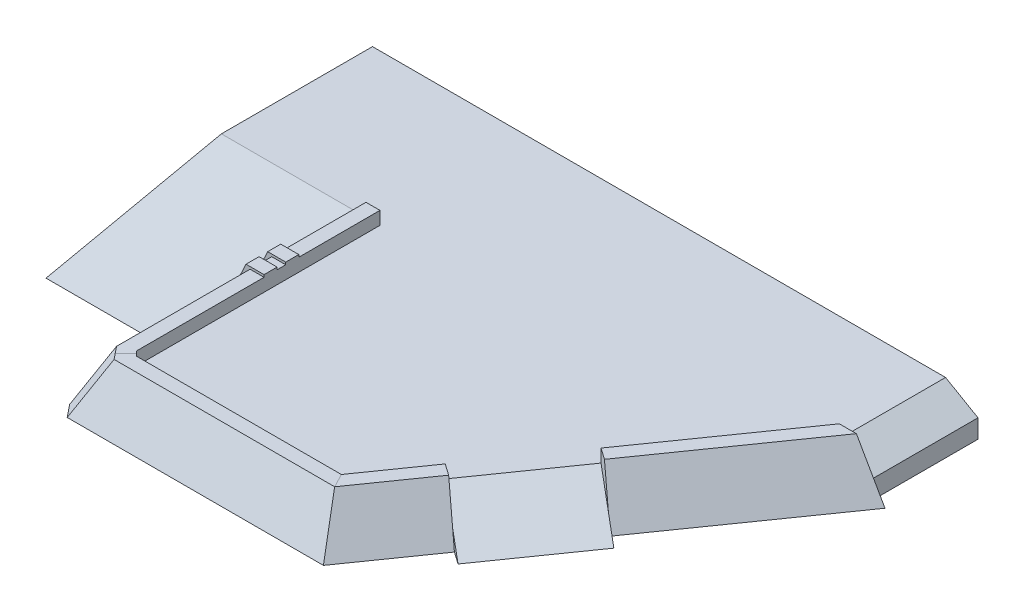
ISO-10303-21;
HEADER;
FILE_DESCRIPTION(('STEP AP214'),'2;1');
FILE_NAME('part.step','',(''),(''),'','','');
FILE_SCHEMA(('AUTOMOTIVE_DESIGN { 1 0 10303 214 1 1 1 1 }'));
ENDSEC;
DATA;
#1=APPLICATION_CONTEXT('core data for automotive mechanical design processes');
#2=APPLICATION_PROTOCOL_DEFINITION('international standard','automotive_design',2000,#1);
#3=PRODUCT_CONTEXT('',#1,'mechanical');
#4=PRODUCT('Part','Part','',(#3));
#5=PRODUCT_RELATED_PRODUCT_CATEGORY('part','',(#4));
#6=PRODUCT_DEFINITION_FORMATION('','',#4);
#7=PRODUCT_DEFINITION_CONTEXT('part definition',#1,'design');
#8=PRODUCT_DEFINITION('design','',#6,#7);
#9=PRODUCT_DEFINITION_SHAPE('','',#8);
#10=(LENGTH_UNIT() NAMED_UNIT(*) SI_UNIT(.MILLI.,.METRE.));
#11=(NAMED_UNIT(*) PLANE_ANGLE_UNIT() SI_UNIT($,.RADIAN.));
#12=(NAMED_UNIT(*) SI_UNIT($,.STERADIAN.) SOLID_ANGLE_UNIT());
#13=UNCERTAINTY_MEASURE_WITH_UNIT(LENGTH_MEASURE(1.E-05),#10,'distance_accuracy_value','');
#14=(GEOMETRIC_REPRESENTATION_CONTEXT(3) GLOBAL_UNCERTAINTY_ASSIGNED_CONTEXT((#13)) GLOBAL_UNIT_ASSIGNED_CONTEXT((#10,
#11,#12)) REPRESENTATION_CONTEXT('',''));
#15=CARTESIAN_POINT('',(0.,0.,0.));
#16=DIRECTION('',(0.,0.,1.));
#17=DIRECTION('',(1.,0.,0.));
#18=AXIS2_PLACEMENT_3D('',#15,#16,#17);
#19=CARTESIAN_POINT('',(6840.82032302756,0.,1140.07438516733));
#20=DIRECTION('',(0.499999999999995,0.866025403784442,0.));
#21=DIRECTION('',(-0.866025403784442,0.499999999999995,0.));
#22=AXIS2_PLACEMENT_3D('',#19,#20,#21);
#23=PLANE('',#22);
#24=DIRECTION('',(-0.866025403784442,0.499999999999995,0.));
#25=VECTOR('',#24,1.);
#26=CARTESIAN_POINT('',(6840.82032302756,0.,1140.07438516733));
#27=LINE('',#26,#25);
#28=CARTESIAN_POINT('',(6495.82032302756,199.185842870418,1140.07438516733));
#29=VERTEX_POINT('',#28);
#30=CARTESIAN_POINT('',(6148.,400.,1140.07438516733));
#31=VERTEX_POINT('',#30);
#32=EDGE_CURVE('E444',#29,#31,#27,.T.);
#33=ORIENTED_EDGE('',*,*,#32,.F.);
#34=DIRECTION('',(0.,0.,-1.));
#35=VECTOR('',#34,1.);
#36=CARTESIAN_POINT('',(6495.82032302756,199.185842870418,1140.07438516733));
#37=LINE('',#36,#35);
#38=CARTESIAN_POINT('',(6495.82032302756,199.185842870418,0.));
#39=VERTEX_POINT('',#38);
#40=EDGE_CURVE('E610',#29,#39,#37,.T.);
#41=ORIENTED_EDGE('',*,*,#40,.T.);
#42=DIRECTION('',(0.866025403784441,-0.499999999999995,0.));
#43=VECTOR('',#42,1.);
#44=CARTESIAN_POINT('',(6840.82032302756,0.,0.));
#45=LINE('',#44,#43);
#46=CARTESIAN_POINT('',(6148.,400.,0.));
#47=VERTEX_POINT('',#46);
#48=EDGE_CURVE('E286',#47,#39,#45,.T.);
#49=ORIENTED_EDGE('',*,*,#48,.F.);
#50=DIRECTION('',(0.,0.,-1.));
#51=VECTOR('',#50,1.);
#52=CARTESIAN_POINT('',(6148.,400.,0.));
#53=LINE('',#52,#51);
#54=EDGE_CURVE('E524',#31,#47,#53,.T.);
#55=ORIENTED_EDGE('',*,*,#54,.F.);
#56=EDGE_LOOP('',(#33,#41,#49,#55));
#57=FACE_BOUND('',#56,.T.);
#58=ADVANCED_FACE('F38',(#57),#23,.T.);
#59=CARTESIAN_POINT('',(0.,400.,0.));
#60=DIRECTION('',(0.,0.,1.));
#61=DIRECTION('',(1.,0.,0.));
#62=AXIS2_PLACEMENT_3D('',#59,#60,#61);
#63=PLANE('',#62);
#64=DIRECTION('',(0.,1.,0.));
#65=VECTOR('',#64,1.);
#66=CARTESIAN_POINT('',(6495.82032302756,400.,0.));
#67=LINE('',#66,#65);
#68=CARTESIAN_POINT('',(6495.82032302756,0.,0.));
#69=VERTEX_POINT('',#68);
#70=EDGE_CURVE('E272',#69,#39,#67,.T.);
#71=ORIENTED_EDGE('',*,*,#70,.F.);
#72=DIRECTION('',(-1.,0.,0.));
#73=VECTOR('',#72,1.);
#74=CARTESIAN_POINT('',(0.,0.,0.));
#75=LINE('',#74,#73);
#76=CARTESIAN_POINT('',(0.,0.,0.));
#77=VERTEX_POINT('',#76);
#78=EDGE_CURVE('E282',#69,#77,#75,.T.);
#79=ORIENTED_EDGE('',*,*,#78,.T.);
#80=DIRECTION('',(0.,-1.,0.));
#81=VECTOR('',#80,1.);
#82=CARTESIAN_POINT('',(0.,400.,0.));
#83=LINE('',#82,#81);
#84=CARTESIAN_POINT('',(0.,400.,0.));
#85=VERTEX_POINT('',#84);
#86=EDGE_CURVE('E300',#85,#77,#83,.T.);
#87=ORIENTED_EDGE('',*,*,#86,.F.);
#88=DIRECTION('',(-1.,0.,0.));
#89=VECTOR('',#88,1.);
#90=CARTESIAN_POINT('',(0.,400.,0.));
#91=LINE('',#90,#89);
#92=EDGE_CURVE('E303',#47,#85,#91,.T.);
#93=ORIENTED_EDGE('',*,*,#92,.F.);
#94=ORIENTED_EDGE('',*,*,#48,.T.);
#95=EDGE_LOOP('',(#71,#79,#87,#93,#94));
#96=FACE_BOUND('',#95,.T.);
#97=ADVANCED_FACE('F280',(#96),#63,.F.);
#98=CARTESIAN_POINT('',(6557.66102481887,539.392949833121,816.534828475489));
#99=DIRECTION('',(-0.742403876506104,-0.422618261740704,-0.519836790725681));
#100=DIRECTION('',(-0.573576436351044,0.,0.819152044288994));
#101=AXIS2_PLACEMENT_3D('',#98,#99,#100);
#102=PLANE('',#101);
#103=DIRECTION('',(-0.346188613058758,0.906307787036648,-0.242403876506106));
#104=VECTOR('',#103,1.);
#105=CARTESIAN_POINT('',(5218.02567934543,539.392949833122,2729.73237687467));
#106=LINE('',#105,#104);
#107=CARTESIAN_POINT('',(5359.04467567405,170.210921101807,2828.47494113473));
#108=VERTEX_POINT('',#107);
#109=CARTESIAN_POINT('',(5218.02567934544,539.392949833121,2729.73237687467));
#110=VERTEX_POINT('',#109);
#111=EDGE_CURVE('E365',#108,#110,#106,.T.);
#112=ORIENTED_EDGE('',*,*,#111,.F.);
#113=DIRECTION('',(-0.346188613058758,0.906307787036648,-0.242403876506106));
#114=VECTOR('',#113,1.);
#115=CARTESIAN_POINT('',(5218.02567934543,539.392949833122,2729.73237687467));
#116=LINE('',#115,#114);
#117=CARTESIAN_POINT('',(5424.06131080233,1.87072206076798E-12,2874.00007916059));
#118=VERTEX_POINT('',#117);
#119=EDGE_CURVE('E11',#118,#108,#116,.T.);
#120=ORIENTED_EDGE('',*,*,#119,.F.);
#121=DIRECTION('',(-0.573576436351044,0.,0.819152044288994));
#122=VECTOR('',#121,1.);
#123=CARTESIAN_POINT('',(6763.69665627577,0.,960.802530761407));
#124=LINE('',#123,#122);
#125=CARTESIAN_POINT('',(6638.16915243191,0.,1140.07438516733));
#126=VERTEX_POINT('',#125);
#127=EDGE_CURVE('E462',#126,#118,#124,.T.);
#128=ORIENTED_EDGE('',*,*,#127,.F.);
#129=DIRECTION('',(0.49471530048269,-0.869055102665142,0.));
#130=VECTOR('',#129,1.);
#131=CARTESIAN_POINT('',(5013.52220252633,2853.98030032064,1140.07438516733));
#132=LINE('',#131,#130);
#133=CARTESIAN_POINT('',(6331.11618831422,539.392949833121,1140.07438516733));
#134=VERTEX_POINT('',#133);
#135=EDGE_CURVE('E302',#134,#126,#132,.T.);
#136=ORIENTED_EDGE('',*,*,#135,.F.);
#137=DIRECTION('',(-0.573576436351044,0.,0.819152044288994));
#138=VECTOR('',#137,1.);
#139=CARTESIAN_POINT('',(6557.66102481887,539.392949833121,816.534828475489));
#140=LINE('',#139,#138);
#141=EDGE_CURVE('E468',#134,#110,#140,.T.);
#142=ORIENTED_EDGE('',*,*,#141,.T.);
#143=EDGE_LOOP('',(#112,#120,#128,#136,#142));
#144=FACE_BOUND('',#143,.T.);
#145=ADVANCED_FACE('F596',(#144),#102,.F.);
#146=CARTESIAN_POINT('',(6434.78821817552,539.392949833121,730.498363022833));
#147=DIRECTION('',(0.,-1.,0.));
#148=DIRECTION('',(1.,0.,0.));
#149=AXIS2_PLACEMENT_3D('',#146,#147,#148);
#150=PLANE('',#149);
#151=DIRECTION('',(-0.819152044288994,0.,-0.573576436351044));
#152=VECTOR('',#151,1.);
#153=CARTESIAN_POINT('',(5095.15287270209,539.392949833121,2643.69591142202));
#154=LINE('',#153,#152);
#155=CARTESIAN_POINT('',(5095.15287270209,539.392949833121,2643.69591142202));
#156=VERTEX_POINT('',#155);
#157=EDGE_CURVE('E369',#110,#156,#154,.T.);
#158=ORIENTED_EDGE('',*,*,#157,.F.);
#159=ORIENTED_EDGE('',*,*,#141,.F.);
#160=DIRECTION('',(-1.,0.,0.));
#161=VECTOR('',#160,1.);
#162=CARTESIAN_POINT('',(6434.78821817552,539.392949833121,1140.07438516733));
#163=LINE('',#162,#161);
#164=CARTESIAN_POINT('',(6148.,539.392949833121,1140.07438516733));
#165=VERTEX_POINT('',#164);
#166=EDGE_CURVE('E446',#134,#165,#163,.T.);
#167=ORIENTED_EDGE('',*,*,#166,.T.);
#168=DIRECTION('',(-0.573576436351044,0.,0.819152044288994));
#169=VECTOR('',#168,1.);
#170=CARTESIAN_POINT('',(6434.78821817552,539.392949833121,730.498363022833));
#171=LINE('',#170,#169);
#172=EDGE_CURVE('E463',#165,#156,#171,.T.);
#173=ORIENTED_EDGE('',*,*,#172,.T.);
#174=EDGE_LOOP('',(#158,#159,#167,#173));
#175=FACE_BOUND('',#174,.T.);
#176=ADVANCED_FACE('F604',(#175),#150,.F.);
#177=CARTESIAN_POINT('',(6434.78821817552,400.,730.498363022832));
#178=DIRECTION('',(0.819152044288994,0.,0.573576436351044));
#179=DIRECTION('',(0.573576436351044,0.,-0.819152044288994));
#180=AXIS2_PLACEMENT_3D('',#177,#178,#179);
#181=PLANE('',#180);
#182=DIRECTION('',(0.,1.,0.));
#183=VECTOR('',#182,1.);
#184=CARTESIAN_POINT('',(5095.15287270209,7.59082913873004E-13,2643.69591142202));
#185=LINE('',#184,#183);
#186=CARTESIAN_POINT('',(5095.15287270209,400.,2643.69591142202));
#187=VERTEX_POINT('',#186);
#188=EDGE_CURVE('E582',#187,#156,#185,.T.);
#189=ORIENTED_EDGE('',*,*,#188,.T.);
#190=ORIENTED_EDGE('',*,*,#172,.F.);
#191=DIRECTION('',(0.,1.,0.));
#192=VECTOR('',#191,1.);
#193=CARTESIAN_POINT('',(6148.,400.,1140.07438516733));
#194=LINE('',#193,#192);
#195=EDGE_CURVE('E442',#31,#165,#194,.T.);
#196=ORIENTED_EDGE('',*,*,#195,.F.);
#197=DIRECTION('',(0.573576436351044,0.,-0.819152044288994));
#198=VECTOR('',#197,1.);
#199=CARTESIAN_POINT('',(6148.,400.,1140.07438516733));
#200=LINE('',#199,#198);
#201=EDGE_CURVE('E520',#187,#31,#200,.T.);
#202=ORIENTED_EDGE('',*,*,#201,.F.);
#203=EDGE_LOOP('',(#189,#190,#196,#202));
#204=FACE_BOUND('',#203,.T.);
#205=ADVANCED_FACE('F607',(#204),#181,.F.);
#206=DIRECTION('',(-0.346188613058758,0.906307787036648,-0.242403876506106));
#207=VECTOR('',#206,1.);
#208=CARTESIAN_POINT('',(4529.73395572418,539.392949833123,3712.71483002146));
#209=LINE('',#208,#207);
#210=CARTESIAN_POINT('',(4735.76958718108,1.92623321199924E-12,3856.98253230738));
#211=VERTEX_POINT('',#210);
#212=CARTESIAN_POINT('',(4670.7529520528,170.210921101807,3811.45739428153));
#213=VERTEX_POINT('',#212);
#214=EDGE_CURVE('E47',#211,#213,#209,.T.);
#215=ORIENTED_EDGE('',*,*,#214,.T.);
#216=DIRECTION('',(-0.346188613058758,0.906307787036648,-0.242403876506106));
#217=VECTOR('',#216,1.);
#218=CARTESIAN_POINT('',(4529.73395572418,539.392949833123,3712.71483002146));
#219=LINE('',#218,#217);
#220=CARTESIAN_POINT('',(4529.73395572418,539.392949833121,3712.71483002146));
#221=VERTEX_POINT('',#220);
#222=EDGE_CURVE('E350',#213,#221,#219,.T.);
#223=ORIENTED_EDGE('',*,*,#222,.T.);
#224=CARTESIAN_POINT('',(4026.08505758276,539.392949833121,4432.));
#225=VERTEX_POINT('',#224);
#226=EDGE_CURVE('E466',#221,#225,#140,.T.);
#227=ORIENTED_EDGE('',*,*,#226,.T.);
#228=DIRECTION('',(-0.214862846534994,0.885140273219939,-0.412747687943871));
#229=VECTOR('',#228,1.);
#230=CARTESIAN_POINT('',(3822.32347132957,1378.80092118057,4040.57763464433));
#231=LINE('',#230,#229);
#232=CARTESIAN_POINT('',(4157.0196767708,0.,4683.523063262));
#233=VERTEX_POINT('',#232);
#234=EDGE_CURVE('E456',#233,#225,#231,.T.);
#235=ORIENTED_EDGE('',*,*,#234,.F.);
#236=EDGE_CURVE('E353',#211,#233,#124,.T.);
#237=ORIENTED_EDGE('',*,*,#236,.F.);
#238=EDGE_LOOP('',(#215,#223,#227,#235,#237));
#239=FACE_BOUND('',#238,.T.);
#240=ADVANCED_FACE('F349',(#239),#102,.F.);
#241=CARTESIAN_POINT('',(1551.,539.392949833121,4723.7753695882));
#242=DIRECTION('',(0.906307787036648,-0.422618261740704,0.));
#243=DIRECTION('',(0.422618261740704,0.906307787036648,0.));
#244=AXIS2_PLACEMENT_3D('',#241,#242,#243);
#245=PLANE('',#244);
#246=DIRECTION('',(-0.422618261740704,-0.906307787036648,0.));
#247=VECTOR('',#246,1.);
#248=CARTESIAN_POINT('',(1551.,539.392949833121,2724.6));
#249=LINE('',#248,#247);
#250=CARTESIAN_POINT('',(1551.,539.392949833121,2724.6));
#251=VERTEX_POINT('',#250);
#252=CARTESIAN_POINT('',(1376.6147519434,165.422578540972,2724.6));
#253=VERTEX_POINT('',#252);
#254=EDGE_CURVE('E395',#251,#253,#249,.T.);
#255=ORIENTED_EDGE('',*,*,#254,.F.);
#256=DIRECTION('',(0.,0.,-1.));
#257=VECTOR('',#256,1.);
#258=CARTESIAN_POINT('',(1551.,539.392949833121,4723.7753695882));
#259=LINE('',#258,#257);
#260=CARTESIAN_POINT('',(1551.,539.392949833121,2631.9));
#261=VERTEX_POINT('',#260);
#262=EDGE_CURVE('E504',#251,#261,#259,.T.);
#263=ORIENTED_EDGE('',*,*,#262,.T.);
#264=DIRECTION('',(-0.422618261740704,-0.906307787036648,0.));
#265=VECTOR('',#264,1.);
#266=CARTESIAN_POINT('',(1551.,539.392949833121,2631.9));
#267=LINE('',#266,#265);
#268=CARTESIAN_POINT('',(1385.80287489995,185.126571807782,2631.9));
#269=VERTEX_POINT('',#268);
#270=EDGE_CURVE('E436',#261,#269,#267,.T.);
#271=ORIENTED_EDGE('',*,*,#270,.T.);
#272=DIRECTION('',(-0.0964983581294288,-0.206941396826368,0.973582726406892));
#273=VECTOR('',#272,1.);
#274=CARTESIAN_POINT('',(1454.24729756067,331.906109873991,1941.35656575835));
#275=LINE('',#274,#273);
#276=EDGE_CURVE('E310',#269,#253,#275,.T.);
#277=ORIENTED_EDGE('',*,*,#276,.T.);
#278=EDGE_LOOP('',(#255,#263,#271,#277));
#279=FACE_BOUND('',#278,.T.);
#280=ADVANCED_FACE('F680',(#279),#245,.F.);
#281=CARTESIAN_POINT('',(1701.,539.392949833121,4723.7753695882));
#282=DIRECTION('',(0.,-1.,0.));
#283=DIRECTION('',(1.,0.,0.));
#284=AXIS2_PLACEMENT_3D('',#281,#282,#283);
#285=PLANE('',#284);
#286=DIRECTION('',(-1.,0.,0.));
#287=VECTOR('',#286,1.);
#288=CARTESIAN_POINT('',(1701.,539.392949833121,2724.6));
#289=LINE('',#288,#287);
#290=CARTESIAN_POINT('',(1701.,539.392949833121,2724.6));
#291=VERTEX_POINT('',#290);
#292=EDGE_CURVE('E341',#291,#251,#289,.T.);
#293=ORIENTED_EDGE('',*,*,#292,.F.);
#294=DIRECTION('',(0.,0.,-1.));
#295=VECTOR('',#294,1.);
#296=CARTESIAN_POINT('',(1701.,539.392949833121,4723.7753695882));
#297=LINE('',#296,#295);
#298=CARTESIAN_POINT('',(1701.,539.392949833121,2631.9));
#299=VERTEX_POINT('',#298);
#300=EDGE_CURVE('E506',#291,#299,#297,.T.);
#301=ORIENTED_EDGE('',*,*,#300,.T.);
#302=DIRECTION('',(-1.,0.,0.));
#303=VECTOR('',#302,1.);
#304=CARTESIAN_POINT('',(1701.,539.392949833121,2631.9));
#305=LINE('',#304,#303);
#306=EDGE_CURVE('E338',#299,#261,#305,.T.);
#307=ORIENTED_EDGE('',*,*,#306,.T.);
#308=ORIENTED_EDGE('',*,*,#262,.F.);
#309=EDGE_LOOP('',(#293,#301,#307,#308));
#310=FACE_BOUND('',#309,.T.);
#311=ADVANCED_FACE('F694',(#310),#285,.F.);
#312=DIRECTION('',(-0.422618261740704,-0.906307787036648,0.));
#313=VECTOR('',#312,1.);
#314=CARTESIAN_POINT('',(1551.,539.392949833121,2491.9));
#315=LINE('',#314,#313);
#316=CARTESIAN_POINT('',(1551.,539.392949833121,2491.9));
#317=VERTEX_POINT('',#316);
#318=CARTESIAN_POINT('',(1399.67922024964,214.884490441584,2491.9));
#319=VERTEX_POINT('',#318);
#320=EDGE_CURVE('E428',#317,#319,#315,.T.);
#321=ORIENTED_EDGE('',*,*,#320,.F.);
#322=CARTESIAN_POINT('',(1551.,539.392949833121,1621.));
#323=VERTEX_POINT('',#322);
#324=EDGE_CURVE('E499',#317,#323,#259,.T.);
#325=ORIENTED_EDGE('',*,*,#324,.T.);
#326=DIRECTION('',(-0.422618261740704,-0.906307787036648,0.));
#327=VECTOR('',#326,1.);
#328=CARTESIAN_POINT('',(1551.,539.392949833121,1621.));
#329=LINE('',#328,#327);
#330=CARTESIAN_POINT('',(1486.,400.,1621.));
#331=VERTEX_POINT('',#330);
#332=EDGE_CURVE('E449',#323,#331,#329,.T.);
#333=ORIENTED_EDGE('',*,*,#332,.T.);
#334=EDGE_CURVE('E306',#331,#319,#275,.T.);
#335=ORIENTED_EDGE('',*,*,#334,.T.);
#336=EDGE_LOOP('',(#321,#325,#333,#335));
#337=FACE_BOUND('',#336,.T.);
#338=ADVANCED_FACE('F547',(#337),#245,.F.);
#339=DIRECTION('',(-1.,0.,0.));
#340=VECTOR('',#339,1.);
#341=CARTESIAN_POINT('',(1701.,539.392949833121,2491.9));
#342=LINE('',#341,#340);
#343=CARTESIAN_POINT('',(1701.,539.392949833121,2491.9));
#344=VERTEX_POINT('',#343);
#345=EDGE_CURVE('E335',#344,#317,#342,.T.);
#346=ORIENTED_EDGE('',*,*,#345,.F.);
#347=CARTESIAN_POINT('',(1701.,539.392949833121,1621.));
#348=VERTEX_POINT('',#347);
#349=EDGE_CURVE('E503',#344,#348,#297,.T.);
#350=ORIENTED_EDGE('',*,*,#349,.T.);
#351=DIRECTION('',(-1.,0.,0.));
#352=VECTOR('',#351,1.);
#353=CARTESIAN_POINT('',(1701.,539.392949833121,1621.));
#354=LINE('',#353,#352);
#355=EDGE_CURVE('E490',#348,#323,#354,.T.);
#356=ORIENTED_EDGE('',*,*,#355,.T.);
#357=ORIENTED_EDGE('',*,*,#324,.F.);
#358=EDGE_LOOP('',(#346,#350,#356,#357));
#359=FACE_BOUND('',#358,.T.);
#360=ADVANCED_FACE('F549',(#359),#285,.F.);
#361=CARTESIAN_POINT('',(-1923.89373789772,400.,1621.));
#362=DIRECTION('',(0.,-0.978147600733807,-0.207911690817752));
#363=DIRECTION('',(0.,0.207911690817752,-0.978147600733807));
#364=AXIS2_PLACEMENT_3D('',#361,#362,#363);
#365=PLANE('',#364);
#366=CARTESIAN_POINT('',(1362.7384065937,135.66465990717,2864.6));
#367=VERTEX_POINT('',#366);
#368=CARTESIAN_POINT('',(1299.476936738,0.,3502.85204379145));
#369=VERTEX_POINT('',#368);
#370=EDGE_CURVE('E305',#367,#369,#275,.T.);
#371=ORIENTED_EDGE('',*,*,#370,.F.);
#372=DIRECTION('',(-1.,0.,0.));
#373=VECTOR('',#372,1.);
#374=CARTESIAN_POINT('',(-1923.89373789772,135.66465990717,2864.6));
#375=LINE('',#374,#373);
#376=CARTESIAN_POINT('',(1307.56951064558,135.66465990717,2864.6));
#377=VERTEX_POINT('',#376);
#378=EDGE_CURVE('E405',#367,#377,#375,.T.);
#379=ORIENTED_EDGE('',*,*,#378,.T.);
#380=DIRECTION('',(0.0964983581294297,0.206941396826367,-0.973582726406892));
#381=VECTOR('',#380,1.);
#382=CARTESIAN_POINT('',(1399.59213068201,333.007805418726,1936.17349572711));
#383=LINE('',#382,#381);
#384=CARTESIAN_POINT('',(1321.44585599527,165.422578540972,2724.6));
#385=VERTEX_POINT('',#384);
#386=EDGE_CURVE('E407',#377,#385,#383,.T.);
#387=ORIENTED_EDGE('',*,*,#386,.T.);
#388=DIRECTION('',(-1.,0.,0.));
#389=VECTOR('',#388,1.);
#390=CARTESIAN_POINT('',(-1923.89373789772,165.422578540972,2724.6));
#391=LINE('',#390,#389);
#392=EDGE_CURVE('E400',#253,#385,#391,.T.);
#393=ORIENTED_EDGE('',*,*,#392,.F.);
#394=ORIENTED_EDGE('',*,*,#276,.F.);
#395=DIRECTION('',(-1.,0.,0.));
#396=VECTOR('',#395,1.);
#397=CARTESIAN_POINT('',(-1923.89373789772,185.126571807782,2631.9));
#398=LINE('',#397,#396);
#399=CARTESIAN_POINT('',(1330.63397895182,185.126571807782,2631.9));
#400=VERTEX_POINT('',#399);
#401=EDGE_CURVE('E438',#269,#400,#398,.T.);
#402=ORIENTED_EDGE('',*,*,#401,.T.);
#403=DIRECTION('',(0.0964983581294297,0.206941396826367,-0.973582726406892));
#404=VECTOR('',#403,1.);
#405=CARTESIAN_POINT('',(1399.59213068201,333.007805418726,1936.17349572711));
#406=LINE('',#405,#404);
#407=CARTESIAN_POINT('',(1344.51032430152,214.884490441584,2491.9));
#408=VERTEX_POINT('',#407);
#409=EDGE_CURVE('E440',#400,#408,#406,.T.);
#410=ORIENTED_EDGE('',*,*,#409,.T.);
#411=DIRECTION('',(-1.,0.,0.));
#412=VECTOR('',#411,1.);
#413=CARTESIAN_POINT('',(-1923.89373789772,214.884490441584,2491.9));
#414=LINE('',#413,#412);
#415=EDGE_CURVE('E433',#319,#408,#414,.T.);
#416=ORIENTED_EDGE('',*,*,#415,.F.);
#417=ORIENTED_EDGE('',*,*,#334,.F.);
#418=DIRECTION('',(1.,0.,0.));
#419=VECTOR('',#418,1.);
#420=CARTESIAN_POINT('',(1701.,400.,1621.));
#421=LINE('',#420,#419);
#422=CARTESIAN_POINT('',(0.,400.,1621.));
#423=VERTEX_POINT('',#422);
#424=EDGE_CURVE('E513',#423,#331,#421,.T.);
#425=ORIENTED_EDGE('',*,*,#424,.F.);
#426=DIRECTION('',(0.,-0.207911690817752,0.978147600733807));
#427=VECTOR('',#426,1.);
#428=CARTESIAN_POINT('',(0.,400.,1621.));
#429=LINE('',#428,#427);
#430=CARTESIAN_POINT('',(0.,0.,3502.85204379145));
#431=VERTEX_POINT('',#430);
#432=EDGE_CURVE('E296',#423,#431,#429,.T.);
#433=ORIENTED_EDGE('',*,*,#432,.T.);
#434=DIRECTION('',(1.,0.,0.));
#435=VECTOR('',#434,1.);
#436=CARTESIAN_POINT('',(-1923.89373789772,0.,3502.85204379145));
#437=LINE('',#436,#435);
#438=EDGE_CURVE('E508',#431,#369,#437,.T.);
#439=ORIENTED_EDGE('',*,*,#438,.T.);
#440=EDGE_LOOP('',(#371,#379,#387,#393,#394,#402,#410,#416,#417,#425,#433,#439));
#441=FACE_BOUND('',#440,.T.);
#442=ADVANCED_FACE('F537',(#441),#365,.F.);
#443=CARTESIAN_POINT('',(0.,400.,1621.));
#444=DIRECTION('',(1.,0.,0.));
#445=DIRECTION('',(0.,0.,-1.));
#446=AXIS2_PLACEMENT_3D('',#443,#444,#445);
#447=PLANE('',#446);
#448=DIRECTION('',(0.,0.,1.));
#449=VECTOR('',#448,1.);
#450=CARTESIAN_POINT('',(0.,0.,1621.));
#451=LINE('',#450,#449);
#452=EDGE_CURVE('E291',#77,#431,#451,.T.);
#453=ORIENTED_EDGE('',*,*,#452,.T.);
#454=ORIENTED_EDGE('',*,*,#432,.F.);
#455=DIRECTION('',(0.,0.,1.));
#456=VECTOR('',#455,1.);
#457=CARTESIAN_POINT('',(0.,400.,1621.));
#458=LINE('',#457,#456);
#459=EDGE_CURVE('E292',#85,#423,#458,.T.);
#460=ORIENTED_EDGE('',*,*,#459,.F.);
#461=ORIENTED_EDGE('',*,*,#86,.T.);
#462=EDGE_LOOP('',(#453,#454,#460,#461));
#463=FACE_BOUND('',#462,.T.);
#464=ADVANCED_FACE('F532',(#463),#447,.F.);
#465=CARTESIAN_POINT('',(0.,400.,0.));
#466=DIRECTION('',(0.,-1.,0.));
#467=DIRECTION('',(0.,0.,-1.));
#468=AXIS2_PLACEMENT_3D('',#465,#466,#467);
#469=PLANE('',#468);
#470=DIRECTION('',(0.,0.,1.));
#471=VECTOR('',#470,1.);
#472=CARTESIAN_POINT('',(1701.,400.,4282.));
#473=LINE('',#472,#471);
#474=CARTESIAN_POINT('',(1701.,400.,1621.));
#475=VERTEX_POINT('',#474);
#476=CARTESIAN_POINT('',(1701.,400.,4232.));
#477=VERTEX_POINT('',#476);
#478=EDGE_CURVE('E516',#475,#477,#473,.T.);
#479=ORIENTED_EDGE('',*,*,#478,.T.);
#480=DIRECTION('',(-0.707106781186549,0.,-0.707106781186546));
#481=VECTOR('',#480,1.);
#482=CARTESIAN_POINT('',(1701.,400.000000000002,4232.));
#483=LINE('',#482,#481);
#484=CARTESIAN_POINT('',(1751.,400.,4282.));
#485=VERTEX_POINT('',#484);
#486=EDGE_CURVE('E326',#477,#485,#483,.F.);
#487=ORIENTED_EDGE('',*,*,#486,.T.);
#488=DIRECTION('',(1.,0.,0.));
#489=VECTOR('',#488,1.);
#490=CARTESIAN_POINT('',(3948.,400.,4282.));
#491=LINE('',#490,#489);
#492=CARTESIAN_POINT('',(3948.,400.,4282.));
#493=VERTEX_POINT('',#492);
#494=EDGE_CURVE('E518',#485,#493,#491,.T.);
#495=ORIENTED_EDGE('',*,*,#494,.T.);
#496=CARTESIAN_POINT('',(4406.86114908083,400.,3626.67836456881));
#497=VERTEX_POINT('',#496);
#498=EDGE_CURVE('E521',#493,#497,#200,.T.);
#499=ORIENTED_EDGE('',*,*,#498,.T.);
#500=DIRECTION('',(-0.573576436351044,0.,0.819152044288993));
#501=VECTOR('',#500,1.);
#502=CARTESIAN_POINT('',(5095.15287270209,400.,2643.69591142202));
#503=LINE('',#502,#501);
#504=EDGE_CURVE('E572',#187,#497,#503,.T.);
#505=ORIENTED_EDGE('',*,*,#504,.F.);
#506=ORIENTED_EDGE('',*,*,#201,.T.);
#507=ORIENTED_EDGE('',*,*,#54,.T.);
#508=ORIENTED_EDGE('',*,*,#92,.T.);
#509=ORIENTED_EDGE('',*,*,#459,.T.);
#510=ORIENTED_EDGE('',*,*,#424,.T.);
#511=EDGE_CURVE('E294',#331,#475,#421,.T.);
#512=ORIENTED_EDGE('',*,*,#511,.T.);
#513=EDGE_LOOP('',(#479,#487,#495,#499,#505,#506,#507,#508,#509,#510,#512));
#514=FACE_BOUND('',#513,.T.);
#515=ADVANCED_FACE('F526',(#514),#469,.F.);
#516=CARTESIAN_POINT('',(0.,0.,0.));
#517=DIRECTION('',(0.,-1.,0.));
#518=DIRECTION('',(0.,0.,-1.));
#519=AXIS2_PLACEMENT_3D('',#516,#517,#518);
#520=PLANE('',#519);
#521=DIRECTION('',(0.627215645974674,0.,0.778845641603375));
#522=VECTOR('',#521,1.);
#523=CARTESIAN_POINT('',(-1433.80239762498,0.,1154.66178275715));
#524=LINE('',#523,#522);
#525=CARTESIAN_POINT('',(1359.61251653149,0.,4623.38748346851));
#526=VERTEX_POINT('',#525);
#527=CARTESIAN_POINT('',(1299.476936738,0.,4548.71406846676));
#528=VERTEX_POINT('',#527);
#529=EDGE_CURVE('E319',#526,#528,#524,.F.);
#530=ORIENTED_EDGE('',*,*,#529,.T.);
#531=DIRECTION('',(0.,0.,-1.));
#532=VECTOR('',#531,1.);
#533=CARTESIAN_POINT('',(1299.476936738,0.,4723.7753695882));
#534=LINE('',#533,#532);
#535=EDGE_CURVE('E496',#528,#369,#534,.T.);
#536=ORIENTED_EDGE('',*,*,#535,.T.);
#537=ORIENTED_EDGE('',*,*,#438,.F.);
#538=ORIENTED_EDGE('',*,*,#452,.F.);
#539=ORIENTED_EDGE('',*,*,#78,.F.);
#540=DIRECTION('',(0.,0.,-1.));
#541=VECTOR('',#540,1.);
#542=CARTESIAN_POINT('',(6495.82032302756,0.,1140.07438516733));
#543=LINE('',#542,#541);
#544=CARTESIAN_POINT('',(6495.82032302756,0.,1140.07438516733));
#545=VERTEX_POINT('',#544);
#546=EDGE_CURVE('E269',#545,#69,#543,.T.);
#547=ORIENTED_EDGE('',*,*,#546,.F.);
#548=DIRECTION('',(1.,0.,0.));
#549=VECTOR('',#548,1.);
#550=CARTESIAN_POINT('',(6495.82032302756,0.,1140.07438516733));
#551=LINE('',#550,#549);
#552=EDGE_CURVE('E54',#545,#126,#551,.T.);
#553=ORIENTED_EDGE('',*,*,#552,.T.);
#554=ORIENTED_EDGE('',*,*,#127,.T.);
#555=DIRECTION('',(-0.819152044288994,0.,-0.573576436351044));
#556=VECTOR('',#555,1.);
#557=CARTESIAN_POINT('',(434.123208674579,7.59082913873004E-13,-619.992195149094));
#558=LINE('',#557,#556);
#559=CARTESIAN_POINT('',(5554.51639726519,8.88178419700125E-13,2965.34571409968));
#560=VERTEX_POINT('',#559);
#561=EDGE_CURVE('E367',#560,#118,#558,.T.);
#562=ORIENTED_EDGE('',*,*,#561,.F.);
#563=DIRECTION('',(-0.573576436351044,0.,0.819152044288994));
#564=VECTOR('',#563,1.);
#565=CARTESIAN_POINT('',(5554.51639726519,8.88178419700125E-13,2965.34571409968));
#566=LINE('',#565,#564);
#567=CARTESIAN_POINT('',(4866.22467364394,8.88178419700125E-13,3948.32816724648));
#568=VERTEX_POINT('',#567);
#569=EDGE_CURVE('E364',#560,#568,#566,.T.);
#570=ORIENTED_EDGE('',*,*,#569,.T.);
#571=DIRECTION('',(-0.819152044288994,0.,-0.573576436351044));
#572=VECTOR('',#571,1.);
#573=CARTESIAN_POINT('',(-254.168514946674,7.59082913873004E-13,362.990257997698));
#574=LINE('',#573,#572);
#575=EDGE_CURVE('E359',#568,#211,#574,.T.);
#576=ORIENTED_EDGE('',*,*,#575,.T.);
#577=ORIENTED_EDGE('',*,*,#236,.T.);
#578=DIRECTION('',(-1.,0.,0.));
#579=VECTOR('',#578,1.);
#580=CARTESIAN_POINT('',(4178.02164444788,0.,4683.523063262));
#581=LINE('',#580,#579);
#582=CARTESIAN_POINT('',(1408.04056762591,0.,4683.523063262));
#583=VERTEX_POINT('',#582);
#584=EDGE_CURVE('E479',#233,#583,#581,.T.);
#585=ORIENTED_EDGE('',*,*,#584,.T.);
#586=DIRECTION('',(0.627215645974674,0.,0.778845641603375));
#587=VECTOR('',#586,1.);
#588=CARTESIAN_POINT('',(-1433.80239762498,0.,1154.66178275715));
#589=LINE('',#588,#587);
#590=EDGE_CURVE('E321',#583,#526,#589,.F.);
#591=ORIENTED_EDGE('',*,*,#590,.T.);
#592=EDGE_LOOP('',(#530,#536,#537,#538,#539,#547,#553,#554,#562,#570,#576,#577,#585,#591));
#593=FACE_BOUND('',#592,.T.);
#594=ADVANCED_FACE('F289',(#593),#520,.T.);
#595=CARTESIAN_POINT('',(-2.22044604925031E-13,0.,1621.));
#596=DIRECTION('',(0.,0.,1.));
#597=DIRECTION('',(1.,0.,0.));
#598=AXIS2_PLACEMENT_3D('',#595,#596,#597);
#599=PLANE('',#598);
#600=DIRECTION('',(0.,1.,0.));
#601=VECTOR('',#600,1.);
#602=CARTESIAN_POINT('',(1701.,400.,1621.));
#603=LINE('',#602,#601);
#604=EDGE_CURVE('E493',#475,#348,#603,.T.);
#605=ORIENTED_EDGE('',*,*,#604,.F.);
#606=ORIENTED_EDGE('',*,*,#511,.F.);
#607=ORIENTED_EDGE('',*,*,#332,.F.);
#608=ORIENTED_EDGE('',*,*,#355,.F.);
#609=EDGE_LOOP('',(#605,#606,#607,#608));
#610=FACE_BOUND('',#609,.T.);
#611=ADVANCED_FACE('F543',(#610),#599,.F.);
#612=CARTESIAN_POINT('',(1551.,539.392949833121,4297.19100520476));
#613=VERTEX_POINT('',#612);
#614=CARTESIAN_POINT('',(1551.,539.392949833121,2864.6));
#615=VERTEX_POINT('',#614);
#616=EDGE_CURVE('E500',#613,#615,#259,.T.);
#617=ORIENTED_EDGE('',*,*,#616,.T.);
#618=DIRECTION('',(-0.422618261740704,-0.906307787036648,0.));
#619=VECTOR('',#618,1.);
#620=CARTESIAN_POINT('',(1551.,539.392949833121,2864.6));
#621=LINE('',#620,#619);
#622=EDGE_CURVE('E403',#615,#367,#621,.T.);
#623=ORIENTED_EDGE('',*,*,#622,.T.);
#624=ORIENTED_EDGE('',*,*,#370,.T.);
#625=ORIENTED_EDGE('',*,*,#535,.F.);
#626=DIRECTION('',(0.389281620635028,0.834817129478985,-0.389281620635028));
#627=VECTOR('',#626,1.);
#628=CARTESIAN_POINT('',(1486.35532856609,400.762004569032,4361.83567663867));
#629=LINE('',#628,#627);
#630=EDGE_CURVE('E309',#528,#613,#629,.T.);
#631=ORIENTED_EDGE('',*,*,#630,.T.);
#632=EDGE_LOOP('',(#617,#623,#624,#625,#631));
#633=FACE_BOUND('',#632,.T.);
#634=ADVANCED_FACE('F626',(#633),#245,.F.);
#635=CARTESIAN_POINT('',(1701.,400.,4723.7753695882));
#636=DIRECTION('',(-1.,0.,0.));
#637=DIRECTION('',(0.,-1.,0.));
#638=AXIS2_PLACEMENT_3D('',#635,#636,#637);
#639=PLANE('',#638);
#640=DIRECTION('',(0.,-1.,0.));
#641=VECTOR('',#640,1.);
#642=CARTESIAN_POINT('',(1701.,400.,4232.));
#643=LINE('',#642,#641);
#644=CARTESIAN_POINT('',(1701.,539.392949833121,4232.));
#645=VERTEX_POINT('',#644);
#646=EDGE_CURVE('E323',#645,#477,#643,.T.);
#647=ORIENTED_EDGE('',*,*,#646,.T.);
#648=ORIENTED_EDGE('',*,*,#478,.F.);
#649=ORIENTED_EDGE('',*,*,#604,.T.);
#650=ORIENTED_EDGE('',*,*,#349,.F.);
#651=DIRECTION('',(0.,-1.,0.));
#652=VECTOR('',#651,1.);
#653=CARTESIAN_POINT('',(1701.,0.,2491.9));
#654=LINE('',#653,#652);
#655=CARTESIAN_POINT('',(1701.,564.392949833121,2491.9));
#656=VERTEX_POINT('',#655);
#657=EDGE_CURVE('E413',#656,#344,#654,.T.);
#658=ORIENTED_EDGE('',*,*,#657,.F.);
#659=DIRECTION('',(0.,0.,-1.));
#660=VECTOR('',#659,1.);
#661=CARTESIAN_POINT('',(1701.,564.392949833121,2631.9));
#662=LINE('',#661,#660);
#663=CARTESIAN_POINT('',(1701.,564.392949833121,2631.9));
#664=VERTEX_POINT('',#663);
#665=EDGE_CURVE('E426',#664,#656,#662,.T.);
#666=ORIENTED_EDGE('',*,*,#665,.F.);
#667=DIRECTION('',(0.,-1.,0.));
#668=VECTOR('',#667,1.);
#669=CARTESIAN_POINT('',(1701.,0.,2631.9));
#670=LINE('',#669,#668);
#671=EDGE_CURVE('E416',#664,#299,#670,.T.);
#672=ORIENTED_EDGE('',*,*,#671,.T.);
#673=ORIENTED_EDGE('',*,*,#300,.F.);
#674=DIRECTION('',(0.,-1.,0.));
#675=VECTOR('',#674,1.);
#676=CARTESIAN_POINT('',(1701.,0.,2724.6));
#677=LINE('',#676,#675);
#678=CARTESIAN_POINT('',(1701.,564.392949833121,2724.6));
#679=VERTEX_POINT('',#678);
#680=EDGE_CURVE('E380',#679,#291,#677,.T.);
#681=ORIENTED_EDGE('',*,*,#680,.F.);
#682=DIRECTION('',(0.,0.,-1.));
#683=VECTOR('',#682,1.);
#684=CARTESIAN_POINT('',(1701.,564.392949833121,2864.6));
#685=LINE('',#684,#683);
#686=CARTESIAN_POINT('',(1701.,564.392949833121,2864.6));
#687=VERTEX_POINT('',#686);
#688=EDGE_CURVE('E393',#687,#679,#685,.T.);
#689=ORIENTED_EDGE('',*,*,#688,.F.);
#690=DIRECTION('',(0.,-1.,0.));
#691=VECTOR('',#690,1.);
#692=CARTESIAN_POINT('',(1701.,0.,2864.6));
#693=LINE('',#692,#691);
#694=CARTESIAN_POINT('',(1701.,539.392949833121,2864.6));
#695=VERTEX_POINT('',#694);
#696=EDGE_CURVE('E383',#687,#695,#693,.T.);
#697=ORIENTED_EDGE('',*,*,#696,.T.);
#698=EDGE_CURVE('E483',#645,#695,#297,.T.);
#699=ORIENTED_EDGE('',*,*,#698,.F.);
#700=EDGE_LOOP('',(#647,#648,#649,#650,#658,#666,#672,#673,#681,#689,#697,#699));
#701=FACE_BOUND('',#700,.T.);
#702=ADVANCED_FACE('F553',(#701),#639,.F.);
#703=ORIENTED_EDGE('',*,*,#698,.T.);
#704=DIRECTION('',(-1.,0.,0.));
#705=VECTOR('',#704,1.);
#706=CARTESIAN_POINT('',(1701.,539.392949833121,2864.6));
#707=LINE('',#706,#705);
#708=EDGE_CURVE('E344',#695,#615,#707,.T.);
#709=ORIENTED_EDGE('',*,*,#708,.T.);
#710=ORIENTED_EDGE('',*,*,#616,.F.);
#711=DIRECTION('',(-0.627215645974674,0.,-0.778845641603375));
#712=VECTOR('',#711,1.);
#713=CARTESIAN_POINT('',(1557.14801244904,539.392949833121,4304.82530567413));
#714=LINE('',#713,#712);
#715=CARTESIAN_POINT('',(1611.13557979349,539.392949833121,4371.86442020651));
#716=VERTEX_POINT('',#715);
#717=EDGE_CURVE('E313',#613,#716,#714,.F.);
#718=ORIENTED_EDGE('',*,*,#717,.T.);
#719=DIRECTION('',(0.707106781186548,0.,-0.707106781186547));
#720=VECTOR('',#719,1.);
#721=CARTESIAN_POINT('',(2939.51082222394,539.392949833122,3043.48917777606));
#722=LINE('',#721,#720);
#723=CARTESIAN_POINT('',(1726.,539.392949833121,4257.));
#724=VERTEX_POINT('',#723);
#725=EDGE_CURVE('E473',#716,#724,#722,.T.);
#726=ORIENTED_EDGE('',*,*,#725,.T.);
#727=DIRECTION('',(0.707106781186549,0.,0.707106781186546));
#728=VECTOR('',#727,1.);
#729=CARTESIAN_POINT('',(1946.8876847941,539.392949833121,4477.8876847941));
#730=LINE('',#729,#728);
#731=EDGE_CURVE('E333',#724,#645,#730,.F.);
#732=ORIENTED_EDGE('',*,*,#731,.T.);
#733=EDGE_LOOP('',(#703,#709,#710,#718,#726,#732));
#734=FACE_BOUND('',#733,.T.);
#735=ADVANCED_FACE('F629',(#734),#285,.F.);
#736=CARTESIAN_POINT('',(4178.02164444788,539.392949833121,4432.));
#737=DIRECTION('',(0.,-0.422618261740704,-0.906307787036648));
#738=DIRECTION('',(0.,0.906307787036648,-0.422618261740704));
#739=AXIS2_PLACEMENT_3D('',#736,#737,#738);
#740=PLANE('',#739);
#741=DIRECTION('',(-1.,0.,0.));
#742=VECTOR('',#741,1.);
#743=CARTESIAN_POINT('',(4178.02164444788,539.392949833121,4432.));
#744=LINE('',#743,#742);
#745=CARTESIAN_POINT('',(1659.56363088792,539.392949833121,4432.));
#746=VERTEX_POINT('',#745);
#747=EDGE_CURVE('E482',#225,#746,#744,.T.);
#748=ORIENTED_EDGE('',*,*,#747,.T.);
#749=DIRECTION('',(-0.389281620635028,-0.834817129478985,0.389281620635028));
#750=VECTOR('',#749,1.);
#751=CARTESIAN_POINT('',(2041.21121199885,1357.83882872125,4050.35241888906));
#752=LINE('',#751,#750);
#753=EDGE_CURVE('E317',#746,#583,#752,.T.);
#754=ORIENTED_EDGE('',*,*,#753,.T.);
#755=ORIENTED_EDGE('',*,*,#584,.F.);
#756=ORIENTED_EDGE('',*,*,#234,.T.);
#757=EDGE_LOOP('',(#748,#754,#755,#756));
#758=FACE_BOUND('',#757,.T.);
#759=ADVANCED_FACE('F691',(#758),#740,.F.);
#760=CARTESIAN_POINT('',(4178.02164444788,539.392949833121,4282.));
#761=DIRECTION('',(0.,-1.,0.));
#762=DIRECTION('',(0.,0.,-1.));
#763=AXIS2_PLACEMENT_3D('',#760,#761,#762);
#764=PLANE('',#763);
#765=ORIENTED_EDGE('',*,*,#725,.F.);
#766=DIRECTION('',(-0.627215645974674,0.,-0.778845641603375));
#767=VECTOR('',#766,1.);
#768=CARTESIAN_POINT('',(1557.14801244904,539.392949833121,4304.82530567413));
#769=LINE('',#768,#767);
#770=EDGE_CURVE('E315',#716,#746,#769,.F.);
#771=ORIENTED_EDGE('',*,*,#770,.T.);
#772=ORIENTED_EDGE('',*,*,#747,.F.);
#773=DIRECTION('',(-0.461748613235035,0.,-0.887010833178221));
#774=VECTOR('',#773,1.);
#775=CARTESIAN_POINT('',(3023.60263390454,539.392949833122,2506.24918151142));
#776=LINE('',#775,#774);
#777=CARTESIAN_POINT('',(3948.,539.392949833121,4282.));
#778=VERTEX_POINT('',#777);
#779=EDGE_CURVE('E453',#225,#778,#776,.T.);
#780=ORIENTED_EDGE('',*,*,#779,.T.);
#781=DIRECTION('',(-1.,0.,0.));
#782=VECTOR('',#781,1.);
#783=CARTESIAN_POINT('',(4178.02164444788,539.392949833121,4282.));
#784=LINE('',#783,#782);
#785=CARTESIAN_POINT('',(1751.,539.392949833121,4282.));
#786=VERTEX_POINT('',#785);
#787=EDGE_CURVE('E478',#778,#786,#784,.T.);
#788=ORIENTED_EDGE('',*,*,#787,.T.);
#789=DIRECTION('',(0.707106781186549,0.,0.707106781186546));
#790=VECTOR('',#789,1.);
#791=CARTESIAN_POINT('',(2964.51082222395,539.39294983312,5495.51082222394));
#792=LINE('',#791,#790);
#793=EDGE_CURVE('E330',#786,#724,#792,.F.);
#794=ORIENTED_EDGE('',*,*,#793,.T.);
#795=EDGE_LOOP('',(#765,#771,#772,#780,#788,#794));
#796=FACE_BOUND('',#795,.T.);
#797=ADVANCED_FACE('F700',(#796),#764,.F.);
#798=CARTESIAN_POINT('',(4178.02164444788,400.,4282.));
#799=DIRECTION('',(0.,0.,1.));
#800=DIRECTION('',(0.,-1.,0.));
#801=AXIS2_PLACEMENT_3D('',#798,#799,#800);
#802=PLANE('',#801);
#803=ORIENTED_EDGE('',*,*,#494,.F.);
#804=DIRECTION('',(0.,1.,0.));
#805=VECTOR('',#804,1.);
#806=CARTESIAN_POINT('',(1751.,539.392949833121,4282.));
#807=LINE('',#806,#805);
#808=EDGE_CURVE('E328',#485,#786,#807,.T.);
#809=ORIENTED_EDGE('',*,*,#808,.T.);
#810=ORIENTED_EDGE('',*,*,#787,.F.);
#811=DIRECTION('',(0.,-1.,0.));
#812=VECTOR('',#811,1.);
#813=CARTESIAN_POINT('',(3948.,399.999999999993,4282.));
#814=LINE('',#813,#812);
#815=EDGE_CURVE('E450',#778,#493,#814,.T.);
#816=ORIENTED_EDGE('',*,*,#815,.T.);
#817=EDGE_LOOP('',(#803,#809,#810,#816));
#818=FACE_BOUND('',#817,.T.);
#819=ADVANCED_FACE('F563',(#818),#802,.F.);
#820=ORIENTED_EDGE('',*,*,#226,.F.);
#821=DIRECTION('',(-0.819152044288994,0.,-0.573576436351044));
#822=VECTOR('',#821,1.);
#823=CARTESIAN_POINT('',(4406.86114908083,539.392949833121,3626.67836456881));
#824=LINE('',#823,#822);
#825=CARTESIAN_POINT('',(4406.86114908084,539.392949833121,3626.67836456881));
#826=VERTEX_POINT('',#825);
#827=EDGE_CURVE('E577',#221,#826,#824,.T.);
#828=ORIENTED_EDGE('',*,*,#827,.T.);
#829=EDGE_CURVE('E467',#826,#778,#171,.T.);
#830=ORIENTED_EDGE('',*,*,#829,.T.);
#831=ORIENTED_EDGE('',*,*,#779,.F.);
#832=EDGE_LOOP('',(#820,#828,#830,#831));
#833=FACE_BOUND('',#832,.T.);
#834=ADVANCED_FACE('F624',(#833),#150,.F.);
#835=ORIENTED_EDGE('',*,*,#829,.F.);
#836=DIRECTION('',(0.,1.,0.));
#837=VECTOR('',#836,1.);
#838=CARTESIAN_POINT('',(4406.86114908084,7.59082913873004E-13,3626.67836456881));
#839=LINE('',#838,#837);
#840=EDGE_CURVE('E570',#497,#826,#839,.T.);
#841=ORIENTED_EDGE('',*,*,#840,.F.);
#842=ORIENTED_EDGE('',*,*,#498,.F.);
#843=ORIENTED_EDGE('',*,*,#815,.F.);
#844=EDGE_LOOP('',(#835,#841,#842,#843));
#845=FACE_BOUND('',#844,.T.);
#846=ADVANCED_FACE('F568',(#845),#181,.F.);
#847=CARTESIAN_POINT('',(0.,0.,1140.07438516733));
#848=DIRECTION('',(0.,0.,1.));
#849=DIRECTION('',(1.,0.,0.));
#850=AXIS2_PLACEMENT_3D('',#847,#848,#849);
#851=PLANE('',#850);
#852=ORIENTED_EDGE('',*,*,#166,.F.);
#853=ORIENTED_EDGE('',*,*,#135,.T.);
#854=ORIENTED_EDGE('',*,*,#552,.F.);
#855=DIRECTION('',(0.,-1.,0.));
#856=VECTOR('',#855,1.);
#857=CARTESIAN_POINT('',(6495.82032302756,400.,1140.07438516733));
#858=LINE('',#857,#856);
#859=EDGE_CURVE('E274',#29,#545,#858,.T.);
#860=ORIENTED_EDGE('',*,*,#859,.F.);
#861=ORIENTED_EDGE('',*,*,#32,.T.);
#862=ORIENTED_EDGE('',*,*,#195,.T.);
#863=EDGE_LOOP('',(#852,#853,#854,#860,#861,#862));
#864=FACE_BOUND('',#863,.T.);
#865=ADVANCED_FACE('F615',(#864),#851,.F.);
#866=CARTESIAN_POINT('',(1486.35532856609,400.762004569032,4361.83567663867));
#867=DIRECTION('',(0.651329340593437,-0.548309849731101,-0.52452492673845));
#868=DIRECTION('',(0.389281620635028,0.834817129478985,-0.389281620635028));
#869=AXIS2_PLACEMENT_3D('',#866,#867,#868);
#870=PLANE('',#869);
#871=ORIENTED_EDGE('',*,*,#590,.F.);
#872=ORIENTED_EDGE('',*,*,#753,.F.);
#873=ORIENTED_EDGE('',*,*,#770,.F.);
#874=ORIENTED_EDGE('',*,*,#717,.F.);
#875=ORIENTED_EDGE('',*,*,#630,.F.);
#876=ORIENTED_EDGE('',*,*,#529,.F.);
#877=EDGE_LOOP('',(#871,#872,#873,#874,#875,#876));
#878=FACE_BOUND('',#877,.T.);
#879=ADVANCED_FACE('F617',(#878),#870,.F.);
#880=CARTESIAN_POINT('',(1701.,400.000000000002,4232.));
#881=DIRECTION('',(0.707106781186546,0.,-0.707106781186549));
#882=DIRECTION('',(0.,1.,0.));
#883=AXIS2_PLACEMENT_3D('',#880,#881,#882);
#884=PLANE('',#883);
#885=ORIENTED_EDGE('',*,*,#793,.F.);
#886=ORIENTED_EDGE('',*,*,#808,.F.);
#887=ORIENTED_EDGE('',*,*,#486,.F.);
#888=ORIENTED_EDGE('',*,*,#646,.F.);
#889=ORIENTED_EDGE('',*,*,#731,.F.);
#890=EDGE_LOOP('',(#885,#886,#887,#888,#889));
#891=FACE_BOUND('',#890,.T.);
#892=ADVANCED_FACE('F41',(#891),#884,.T.);
#893=CARTESIAN_POINT('',(1507.48879550575,564.392949833121,2631.9));
#894=DIRECTION('',(-0.906307787036646,0.422618261740707,0.));
#895=DIRECTION('',(-0.422618261740707,-0.906307787036647,0.));
#896=AXIS2_PLACEMENT_3D('',#893,#894,#895);
#897=PLANE('',#896);
#898=ORIENTED_EDGE('',*,*,#409,.F.);
#899=DIRECTION('',(0.422618261740707,0.906307787036647,0.));
#900=VECTOR('',#899,1.);
#901=CARTESIAN_POINT('',(1507.48879550575,564.392949833121,2631.9));
#902=LINE('',#901,#900);
#903=CARTESIAN_POINT('',(1507.48879550575,564.392949833121,2631.9));
#904=VERTEX_POINT('',#903);
#905=EDGE_CURVE('E410',#400,#904,#902,.T.);
#906=ORIENTED_EDGE('',*,*,#905,.T.);
#907=DIRECTION('',(0.,0.,-1.));
#908=VECTOR('',#907,1.);
#909=CARTESIAN_POINT('',(1507.48879550575,564.392949833121,2631.9));
#910=LINE('',#909,#908);
#911=CARTESIAN_POINT('',(1507.48879550575,564.392949833121,2491.9));
#912=VERTEX_POINT('',#911);
#913=EDGE_CURVE('E419',#904,#912,#910,.T.);
#914=ORIENTED_EDGE('',*,*,#913,.T.);
#915=DIRECTION('',(0.422618261740707,0.906307787036647,0.));
#916=VECTOR('',#915,1.);
#917=CARTESIAN_POINT('',(1507.48879550575,564.392949833121,2491.9));
#918=LINE('',#917,#916);
#919=EDGE_CURVE('E409',#408,#912,#918,.T.);
#920=ORIENTED_EDGE('',*,*,#919,.F.);
#921=EDGE_LOOP('',(#898,#906,#914,#920));
#922=FACE_BOUND('',#921,.T.);
#923=ADVANCED_FACE('F838',(#922),#897,.T.);
#924=CARTESIAN_POINT('',(0.,0.,2631.9));
#925=DIRECTION('',(0.,0.,1.));
#926=DIRECTION('',(1.,0.,0.));
#927=AXIS2_PLACEMENT_3D('',#924,#925,#926);
#928=PLANE('',#927);
#929=ORIENTED_EDGE('',*,*,#401,.F.);
#930=ORIENTED_EDGE('',*,*,#270,.F.);
#931=ORIENTED_EDGE('',*,*,#306,.F.);
#932=ORIENTED_EDGE('',*,*,#671,.F.);
#933=DIRECTION('',(1.,0.,0.));
#934=VECTOR('',#933,1.);
#935=CARTESIAN_POINT('',(1701.,564.392949833121,2631.9));
#936=LINE('',#935,#934);
#937=EDGE_CURVE('E412',#904,#664,#936,.T.);
#938=ORIENTED_EDGE('',*,*,#937,.F.);
#939=ORIENTED_EDGE('',*,*,#905,.F.);
#940=EDGE_LOOP('',(#929,#930,#931,#932,#938,#939));
#941=FACE_BOUND('',#940,.T.);
#942=ADVANCED_FACE('F843',(#941),#928,.T.);
#943=CARTESIAN_POINT('',(0.,0.,2491.9));
#944=DIRECTION('',(0.,0.,1.));
#945=DIRECTION('',(1.,0.,0.));
#946=AXIS2_PLACEMENT_3D('',#943,#944,#945);
#947=PLANE('',#946);
#948=ORIENTED_EDGE('',*,*,#320,.T.);
#949=ORIENTED_EDGE('',*,*,#415,.T.);
#950=ORIENTED_EDGE('',*,*,#919,.T.);
#951=DIRECTION('',(1.,0.,0.));
#952=VECTOR('',#951,1.);
#953=CARTESIAN_POINT('',(1701.,564.392949833121,2491.9));
#954=LINE('',#953,#952);
#955=EDGE_CURVE('E421',#912,#656,#954,.T.);
#956=ORIENTED_EDGE('',*,*,#955,.T.);
#957=ORIENTED_EDGE('',*,*,#657,.T.);
#958=ORIENTED_EDGE('',*,*,#345,.T.);
#959=EDGE_LOOP('',(#948,#949,#950,#956,#957,#958));
#960=FACE_BOUND('',#959,.T.);
#961=ADVANCED_FACE('F854',(#960),#947,.F.);
#962=CARTESIAN_POINT('',(1701.,564.392949833121,2631.9));
#963=DIRECTION('',(0.,1.,0.));
#964=DIRECTION('',(0.,0.,1.));
#965=AXIS2_PLACEMENT_3D('',#962,#963,#964);
#966=PLANE('',#965);
#967=ORIENTED_EDGE('',*,*,#955,.F.);
#968=ORIENTED_EDGE('',*,*,#913,.F.);
#969=ORIENTED_EDGE('',*,*,#937,.T.);
#970=ORIENTED_EDGE('',*,*,#665,.T.);
#971=EDGE_LOOP('',(#967,#968,#969,#970));
#972=FACE_BOUND('',#971,.T.);
#973=ADVANCED_FACE('F863',(#972),#966,.T.);
#974=CARTESIAN_POINT('',(1507.48879550575,564.392949833121,2864.6));
#975=DIRECTION('',(-0.906307787036646,0.422618261740707,0.));
#976=DIRECTION('',(-0.422618261740707,-0.906307787036647,0.));
#977=AXIS2_PLACEMENT_3D('',#974,#975,#976);
#978=PLANE('',#977);
#979=ORIENTED_EDGE('',*,*,#386,.F.);
#980=DIRECTION('',(0.422618261740707,0.906307787036647,0.));
#981=VECTOR('',#980,1.);
#982=CARTESIAN_POINT('',(1507.48879550575,564.392949833121,2864.6));
#983=LINE('',#982,#981);
#984=CARTESIAN_POINT('',(1507.48879550575,564.392949833121,2864.6));
#985=VERTEX_POINT('',#984);
#986=EDGE_CURVE('E377',#377,#985,#983,.T.);
#987=ORIENTED_EDGE('',*,*,#986,.T.);
#988=DIRECTION('',(0.,0.,-1.));
#989=VECTOR('',#988,1.);
#990=CARTESIAN_POINT('',(1507.48879550575,564.392949833121,2864.6));
#991=LINE('',#990,#989);
#992=CARTESIAN_POINT('',(1507.48879550575,564.392949833121,2724.6));
#993=VERTEX_POINT('',#992);
#994=EDGE_CURVE('E386',#985,#993,#991,.T.);
#995=ORIENTED_EDGE('',*,*,#994,.T.);
#996=DIRECTION('',(0.422618261740707,0.906307787036647,0.));
#997=VECTOR('',#996,1.);
#998=CARTESIAN_POINT('',(1507.48879550575,564.392949833121,2724.6));
#999=LINE('',#998,#997);
#1000=EDGE_CURVE('E376',#385,#993,#999,.T.);
#1001=ORIENTED_EDGE('',*,*,#1000,.F.);
#1002=EDGE_LOOP('',(#979,#987,#995,#1001));
#1003=FACE_BOUND('',#1002,.T.);
#1004=ADVANCED_FACE('F872',(#1003),#978,.T.);
#1005=CARTESIAN_POINT('',(0.,0.,2864.6));
#1006=DIRECTION('',(0.,0.,1.));
#1007=DIRECTION('',(1.,0.,0.));
#1008=AXIS2_PLACEMENT_3D('',#1005,#1006,#1007);
#1009=PLANE('',#1008);
#1010=ORIENTED_EDGE('',*,*,#378,.F.);
#1011=ORIENTED_EDGE('',*,*,#622,.F.);
#1012=ORIENTED_EDGE('',*,*,#708,.F.);
#1013=ORIENTED_EDGE('',*,*,#696,.F.);
#1014=DIRECTION('',(1.,0.,0.));
#1015=VECTOR('',#1014,1.);
#1016=CARTESIAN_POINT('',(1701.,564.392949833121,2864.6));
#1017=LINE('',#1016,#1015);
#1018=EDGE_CURVE('E379',#985,#687,#1017,.T.);
#1019=ORIENTED_EDGE('',*,*,#1018,.F.);
#1020=ORIENTED_EDGE('',*,*,#986,.F.);
#1021=EDGE_LOOP('',(#1010,#1011,#1012,#1013,#1019,#1020));
#1022=FACE_BOUND('',#1021,.T.);
#1023=ADVANCED_FACE('F881',(#1022),#1009,.T.);
#1024=CARTESIAN_POINT('',(0.,0.,2724.6));
#1025=DIRECTION('',(0.,0.,1.));
#1026=DIRECTION('',(1.,0.,0.));
#1027=AXIS2_PLACEMENT_3D('',#1024,#1025,#1026);
#1028=PLANE('',#1027);
#1029=ORIENTED_EDGE('',*,*,#254,.T.);
#1030=ORIENTED_EDGE('',*,*,#392,.T.);
#1031=ORIENTED_EDGE('',*,*,#1000,.T.);
#1032=DIRECTION('',(1.,0.,0.));
#1033=VECTOR('',#1032,1.);
#1034=CARTESIAN_POINT('',(1701.,564.392949833121,2724.6));
#1035=LINE('',#1034,#1033);
#1036=EDGE_CURVE('E388',#993,#679,#1035,.T.);
#1037=ORIENTED_EDGE('',*,*,#1036,.T.);
#1038=ORIENTED_EDGE('',*,*,#680,.T.);
#1039=ORIENTED_EDGE('',*,*,#292,.T.);
#1040=EDGE_LOOP('',(#1029,#1030,#1031,#1037,#1038,#1039));
#1041=FACE_BOUND('',#1040,.T.);
#1042=ADVANCED_FACE('F889',(#1041),#1028,.F.);
#1043=CARTESIAN_POINT('',(1701.,564.392949833121,2864.6));
#1044=DIRECTION('',(0.,1.,0.));
#1045=DIRECTION('',(0.,0.,1.));
#1046=AXIS2_PLACEMENT_3D('',#1043,#1044,#1045);
#1047=PLANE('',#1046);
#1048=ORIENTED_EDGE('',*,*,#1036,.F.);
#1049=ORIENTED_EDGE('',*,*,#994,.F.);
#1050=ORIENTED_EDGE('',*,*,#1018,.T.);
#1051=ORIENTED_EDGE('',*,*,#688,.T.);
#1052=EDGE_LOOP('',(#1048,#1049,#1050,#1051));
#1053=FACE_BOUND('',#1052,.T.);
#1054=ADVANCED_FACE('F737',(#1053),#1047,.T.);
#1055=CARTESIAN_POINT('',(434.123208674579,7.59082913873004E-13,-619.992195149094));
#1056=DIRECTION('',(-0.573576436351044,0.,0.819152044288994));
#1057=DIRECTION('',(0.819152044288994,0.,0.573576436351044));
#1058=AXIS2_PLACEMENT_3D('',#1055,#1056,#1057);
#1059=PLANE('',#1058);
#1060=ORIENTED_EDGE('',*,*,#561,.T.);
#1061=ORIENTED_EDGE('',*,*,#119,.T.);
#1062=DIRECTION('',(0.666884391148975,-0.580702955710935,0.466957477796902));
#1063=VECTOR('',#1062,1.);
#1064=CARTESIAN_POINT('',(2160.80132271764,2955.14545067569,589.040836365571));
#1065=LINE('',#1064,#1063);
#1066=EDGE_CURVE('E372',#108,#560,#1065,.T.);
#1067=ORIENTED_EDGE('',*,*,#1066,.T.);
#1068=EDGE_LOOP('',(#1060,#1061,#1067));
#1069=FACE_BOUND('',#1068,.T.);
#1070=ADVANCED_FACE('F591',(#1069),#1059,.F.);
#1071=CARTESIAN_POINT('',(-254.168514946674,7.59082913873004E-13,362.990257997698));
#1072=DIRECTION('',(-0.573576436351044,0.,0.819152044288994));
#1073=DIRECTION('',(0.819152044288994,0.,0.573576436351044));
#1074=AXIS2_PLACEMENT_3D('',#1071,#1072,#1073);
#1075=PLANE('',#1074);
#1076=ORIENTED_EDGE('',*,*,#214,.F.);
#1077=ORIENTED_EDGE('',*,*,#575,.F.);
#1078=DIRECTION('',(0.666884391148975,-0.580702955710935,0.466957477796902));
#1079=VECTOR('',#1078,1.);
#1080=CARTESIAN_POINT('',(1472.50959909639,2955.14545067569,1572.02328951236));
#1081=LINE('',#1080,#1079);
#1082=EDGE_CURVE('E360',#213,#568,#1081,.T.);
#1083=ORIENTED_EDGE('',*,*,#1082,.F.);
#1084=EDGE_LOOP('',(#1076,#1077,#1083));
#1085=FACE_BOUND('',#1084,.T.);
#1086=ADVANCED_FACE('F358',(#1085),#1075,.T.);
#1087=CARTESIAN_POINT('',(2160.80132271764,2955.14545067569,589.040836365571));
#1088=DIRECTION('',(-0.475684013295273,-0.814115518356323,-0.333077531915196));
#1089=DIRECTION('',(0.863417117550943,-0.504490714602381,0.));
#1090=AXIS2_PLACEMENT_3D('',#1087,#1088,#1089);
#1091=PLANE('',#1090);
#1092=ORIENTED_EDGE('',*,*,#1066,.F.);
#1093=DIRECTION('',(0.666884391148975,-0.580702955710935,0.466957477796902));
#1094=VECTOR('',#1093,1.);
#1095=CARTESIAN_POINT('',(2160.80132271764,2955.14545067569,589.040836365571));
#1096=LINE('',#1095,#1094);
#1097=EDGE_CURVE('E578',#187,#108,#1096,.T.);
#1098=ORIENTED_EDGE('',*,*,#1097,.F.);
#1099=ORIENTED_EDGE('',*,*,#504,.T.);
#1100=DIRECTION('',(0.666884391148975,-0.580702955710935,0.466957477796902));
#1101=VECTOR('',#1100,1.);
#1102=CARTESIAN_POINT('',(1472.50959909639,2955.14545067569,1572.02328951236));
#1103=LINE('',#1102,#1101);
#1104=EDGE_CURVE('E62',#497,#213,#1103,.T.);
#1105=ORIENTED_EDGE('',*,*,#1104,.T.);
#1106=ORIENTED_EDGE('',*,*,#1082,.T.);
#1107=ORIENTED_EDGE('',*,*,#569,.F.);
#1108=EDGE_LOOP('',(#1092,#1098,#1099,#1105,#1106,#1107));
#1109=FACE_BOUND('',#1108,.T.);
#1110=ADVANCED_FACE('F592',(#1109),#1091,.F.);
#1111=CARTESIAN_POINT('',(434.123208674579,7.59082913873004E-13,-619.992195149094));
#1112=DIRECTION('',(-0.573576436351044,0.,0.819152044288994));
#1113=DIRECTION('',(0.819152044288994,0.,0.573576436351044));
#1114=AXIS2_PLACEMENT_3D('',#1111,#1112,#1113);
#1115=PLANE('',#1114);
#1116=ORIENTED_EDGE('',*,*,#111,.T.);
#1117=ORIENTED_EDGE('',*,*,#157,.T.);
#1118=ORIENTED_EDGE('',*,*,#188,.F.);
#1119=ORIENTED_EDGE('',*,*,#1097,.T.);
#1120=EDGE_LOOP('',(#1116,#1117,#1118,#1119));
#1121=FACE_BOUND('',#1120,.T.);
#1122=ADVANCED_FACE('F601',(#1121),#1115,.T.);
#1123=CARTESIAN_POINT('',(-254.168514946674,7.59082913873004E-13,362.990257997698));
#1124=DIRECTION('',(-0.573576436351044,0.,0.819152044288994));
#1125=DIRECTION('',(0.819152044288994,0.,0.573576436351044));
#1126=AXIS2_PLACEMENT_3D('',#1123,#1124,#1125);
#1127=PLANE('',#1126);
#1128=ORIENTED_EDGE('',*,*,#1104,.F.);
#1129=ORIENTED_EDGE('',*,*,#840,.T.);
#1130=ORIENTED_EDGE('',*,*,#827,.F.);
#1131=ORIENTED_EDGE('',*,*,#222,.F.);
#1132=EDGE_LOOP('',(#1128,#1129,#1130,#1131));
#1133=FACE_BOUND('',#1132,.T.);
#1134=ADVANCED_FACE('F765',(#1133),#1127,.F.);
#1135=CARTESIAN_POINT('',(6495.82032302756,0.,0.));
#1136=DIRECTION('',(1.,0.,0.));
#1137=DIRECTION('',(0.,0.,-1.));
#1138=AXIS2_PLACEMENT_3D('',#1135,#1136,#1137);
#1139=PLANE('',#1138);
#1140=ORIENTED_EDGE('',*,*,#859,.T.);
#1141=ORIENTED_EDGE('',*,*,#546,.T.);
#1142=ORIENTED_EDGE('',*,*,#70,.T.);
#1143=ORIENTED_EDGE('',*,*,#40,.F.);
#1144=EDGE_LOOP('',(#1140,#1141,#1142,#1143));
#1145=FACE_BOUND('',#1144,.T.);
#1146=ADVANCED_FACE('F271',(#1145),#1139,.T.);
#1147=CLOSED_SHELL('',(#58,#97,#145,#176,#205,#240,#280,#311,#338,#360,#442,#464,#515,#594,#611,
#634,#702,#735,#759,#797,#819,#834,#846,#865,#879,#892,#923,#942,#961,#973,#1004,#1023,#1042,
#1054,#1070,#1086,#1110,#1122,#1134,#1146));
#1148=MANIFOLD_SOLID_BREP('B2',#1147);
#1149=ADVANCED_BREP_SHAPE_REPRESENTATION('',(#18,#1148),#14);
#1150=SHAPE_DEFINITION_REPRESENTATION(#9,#1149);
ENDSEC;
END-ISO-10303-21;
